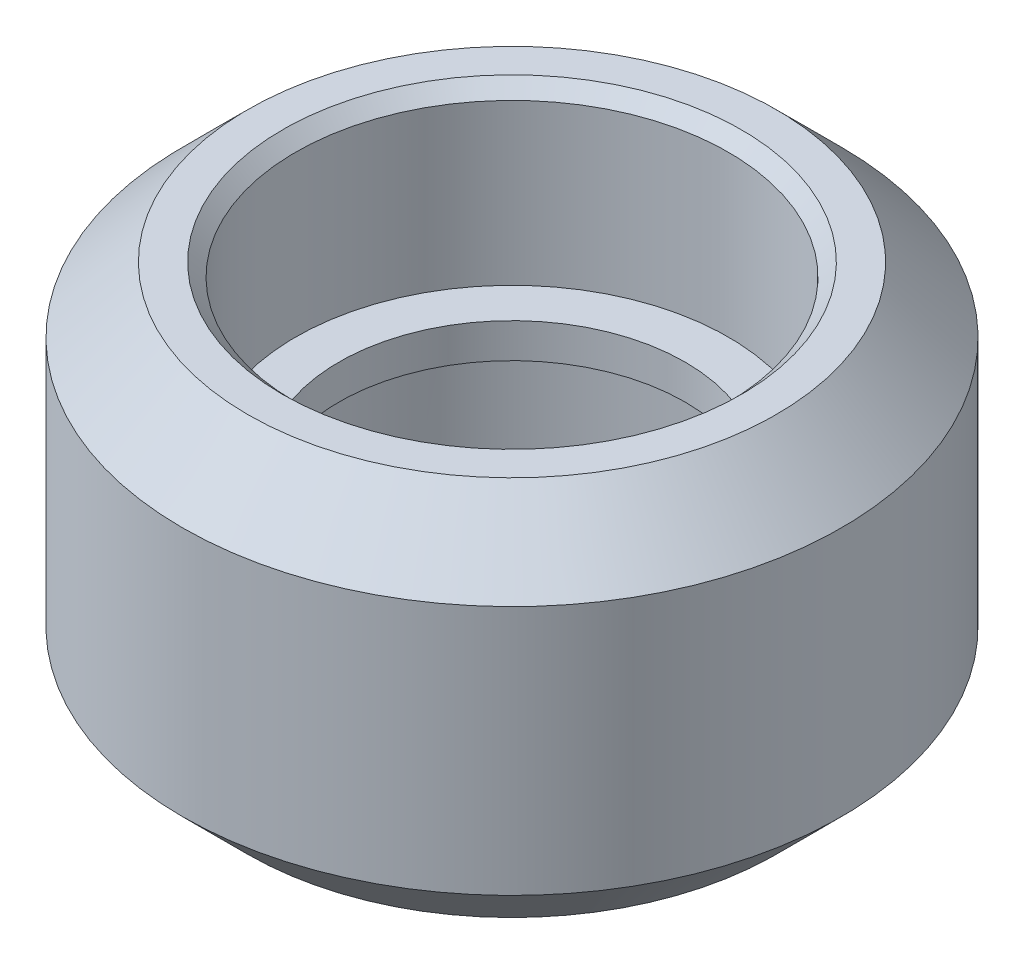
ISO-10303-21;
HEADER;
FILE_DESCRIPTION(('STEP AP214'),'2;1');
FILE_NAME('part.step','',(''),(''),'','','');
FILE_SCHEMA(('AUTOMOTIVE_DESIGN { 1 0 10303 214 1 1 1 1 }'));
ENDSEC;
DATA;
#1=APPLICATION_CONTEXT('core data for automotive mechanical design processes');
#2=APPLICATION_PROTOCOL_DEFINITION('international standard','automotive_design',2000,#1);
#3=PRODUCT_CONTEXT('',#1,'mechanical');
#4=PRODUCT('Part','Part','',(#3));
#5=PRODUCT_RELATED_PRODUCT_CATEGORY('part','',(#4));
#6=PRODUCT_DEFINITION_FORMATION('','',#4);
#7=PRODUCT_DEFINITION_CONTEXT('part definition',#1,'design');
#8=PRODUCT_DEFINITION('design','',#6,#7);
#9=PRODUCT_DEFINITION_SHAPE('','',#8);
#10=(LENGTH_UNIT() NAMED_UNIT(*) SI_UNIT(.MILLI.,.METRE.));
#11=(NAMED_UNIT(*) PLANE_ANGLE_UNIT() SI_UNIT($,.RADIAN.));
#12=(NAMED_UNIT(*) SI_UNIT($,.STERADIAN.) SOLID_ANGLE_UNIT());
#13=UNCERTAINTY_MEASURE_WITH_UNIT(LENGTH_MEASURE(1.E-05),#10,'distance_accuracy_value','');
#14=(GEOMETRIC_REPRESENTATION_CONTEXT(3) GLOBAL_UNCERTAINTY_ASSIGNED_CONTEXT((#13)) GLOBAL_UNIT_ASSIGNED_CONTEXT((#10,
#11,#12)) REPRESENTATION_CONTEXT('',''));
#15=CARTESIAN_POINT('',(0.,0.,0.));
#16=DIRECTION('',(0.,0.,1.));
#17=DIRECTION('',(1.,0.,0.));
#18=AXIS2_PLACEMENT_3D('',#15,#16,#17);
#19=CARTESIAN_POINT('',(0.,8.8,0.));
#20=DIRECTION('',(0.,-1.,0.));
#21=DIRECTION('',(0.,0.,-1.));
#22=AXIS2_PLACEMENT_3D('',#19,#20,#21);
#23=CYLINDRICAL_SURFACE('',#22,4.);
#24=CARTESIAN_POINT('',(0.,4.8,0.));
#25=DIRECTION('',(0.,1.,0.));
#26=DIRECTION('',(0.,0.,1.));
#27=AXIS2_PLACEMENT_3D('',#24,#25,#26);
#28=CIRCLE('',#27,4.);
#29=CARTESIAN_POINT('',(0.,4.8,4.));
#30=VERTEX_POINT('',#29);
#31=EDGE_CURVE('E63',#30,#30,#28,.T.);
#32=ORIENTED_EDGE('',*,*,#31,.T.);
#33=EDGE_LOOP('',(#32));
#34=FACE_BOUND('',#33,.T.);
#35=CARTESIAN_POINT('',(0.,4.,0.));
#36=DIRECTION('',(0.,-1.,0.));
#37=DIRECTION('',(0.,0.,-1.));
#38=AXIS2_PLACEMENT_3D('',#35,#36,#37);
#39=CIRCLE('',#38,4.);
#40=CARTESIAN_POINT('',(0.,4.,-4.));
#41=VERTEX_POINT('',#40);
#42=EDGE_CURVE('E64',#41,#41,#39,.T.);
#43=ORIENTED_EDGE('',*,*,#42,.T.);
#44=EDGE_LOOP('',(#43));
#45=FACE_BOUND('',#44,.T.);
#46=ADVANCED_FACE('F31',(#34,#45),#23,.F.);
#47=CARTESIAN_POINT('',(0.,8.8,0.));
#48=DIRECTION('',(0.,1.,0.));
#49=DIRECTION('',(0.,0.,1.));
#50=AXIS2_PLACEMENT_3D('',#47,#48,#49);
#51=PLANE('',#50);
#52=CARTESIAN_POINT('',(0.,8.8,0.));
#53=DIRECTION('',(0.,1.,0.));
#54=DIRECTION('',(0.,0.,1.));
#55=AXIS2_PLACEMENT_3D('',#52,#53,#54);
#56=CIRCLE('',#55,6.105);
#57=CARTESIAN_POINT('',(0.,8.8,6.105));
#58=VERTEX_POINT('',#57);
#59=EDGE_CURVE('E46',#58,#58,#56,.T.);
#60=ORIENTED_EDGE('',*,*,#59,.T.);
#61=EDGE_LOOP('',(#60));
#62=FACE_BOUND('',#61,.T.);
#63=CARTESIAN_POINT('',(0.,8.8,0.));
#64=DIRECTION('',(0.,1.,0.));
#65=DIRECTION('',(0.,0.,1.));
#66=AXIS2_PLACEMENT_3D('',#63,#64,#65);
#67=CIRCLE('',#66,5.30000000000001);
#68=CARTESIAN_POINT('',(0.,8.8,5.30000000000001));
#69=VERTEX_POINT('',#68);
#70=EDGE_CURVE('E57',#69,#69,#67,.F.);
#71=ORIENTED_EDGE('',*,*,#70,.T.);
#72=EDGE_LOOP('',(#71));
#73=FACE_BOUND('',#72,.T.);
#74=ADVANCED_FACE('F94',(#62,#73),#51,.T.);
#75=CARTESIAN_POINT('',(0.,0.,0.));
#76=DIRECTION('',(0.,1.,0.));
#77=DIRECTION('',(0.,0.,1.));
#78=AXIS2_PLACEMENT_3D('',#75,#76,#77);
#79=PLANE('',#78);
#80=CARTESIAN_POINT('',(0.,0.,0.));
#81=DIRECTION('',(0.,1.,0.));
#82=DIRECTION('',(0.,0.,1.));
#83=AXIS2_PLACEMENT_3D('',#80,#81,#82);
#84=CIRCLE('',#83,6.10499999999999);
#85=CARTESIAN_POINT('',(0.,0.,6.10499999999999));
#86=VERTEX_POINT('',#85);
#87=EDGE_CURVE('E10',#86,#86,#84,.F.);
#88=ORIENTED_EDGE('',*,*,#87,.T.);
#89=EDGE_LOOP('',(#88));
#90=FACE_BOUND('',#89,.T.);
#91=CARTESIAN_POINT('',(0.,0.,0.));
#92=DIRECTION('',(0.,1.,0.));
#93=DIRECTION('',(0.,0.,1.));
#94=AXIS2_PLACEMENT_3D('',#91,#92,#93);
#95=CIRCLE('',#94,5.3);
#96=CARTESIAN_POINT('',(0.,0.,5.3));
#97=VERTEX_POINT('',#96);
#98=EDGE_CURVE('E51',#97,#97,#95,.T.);
#99=ORIENTED_EDGE('',*,*,#98,.T.);
#100=EDGE_LOOP('',(#99));
#101=FACE_BOUND('',#100,.T.);
#102=ADVANCED_FACE('F100',(#90,#101),#79,.F.);
#103=CARTESIAN_POINT('',(0.,8.8,0.));
#104=DIRECTION('',(0.,-1.,0.));
#105=DIRECTION('',(0.,0.,-1.));
#106=AXIS2_PLACEMENT_3D('',#103,#104,#105);
#107=CYLINDRICAL_SURFACE('',#106,7.615);
#108=CARTESIAN_POINT('',(0.,7.29,0.));
#109=DIRECTION('',(0.,1.,0.));
#110=DIRECTION('',(0.,0.,1.));
#111=AXIS2_PLACEMENT_3D('',#108,#109,#110);
#112=CIRCLE('',#111,7.615);
#113=CARTESIAN_POINT('',(0.,7.29,7.615));
#114=VERTEX_POINT('',#113);
#115=EDGE_CURVE('E38',#114,#114,#112,.F.);
#116=ORIENTED_EDGE('',*,*,#115,.T.);
#117=EDGE_LOOP('',(#116));
#118=FACE_BOUND('',#117,.T.);
#119=CARTESIAN_POINT('',(0.,1.51,0.));
#120=DIRECTION('',(0.,1.,0.));
#121=DIRECTION('',(0.,0.,1.));
#122=AXIS2_PLACEMENT_3D('',#119,#120,#121);
#123=CIRCLE('',#122,7.615);
#124=CARTESIAN_POINT('',(0.,1.51,7.615));
#125=VERTEX_POINT('',#124);
#126=EDGE_CURVE('E42',#125,#125,#123,.T.);
#127=ORIENTED_EDGE('',*,*,#126,.T.);
#128=EDGE_LOOP('',(#127));
#129=FACE_BOUND('',#128,.T.);
#130=ADVANCED_FACE('F108',(#118,#129),#107,.T.);
#131=CARTESIAN_POINT('',(0.,4.8,0.));
#132=DIRECTION('',(0.,1.,0.));
#133=DIRECTION('',(0.,0.,1.));
#134=AXIS2_PLACEMENT_3D('',#131,#132,#133);
#135=CYLINDRICAL_SURFACE('',#134,5.);
#136=CARTESIAN_POINT('',(0.,8.49999999999999,0.));
#137=DIRECTION('',(0.,1.,0.));
#138=DIRECTION('',(0.,0.,1.));
#139=AXIS2_PLACEMENT_3D('',#136,#137,#138);
#140=CIRCLE('',#139,5.);
#141=CARTESIAN_POINT('',(0.,8.49999999999999,5.));
#142=VERTEX_POINT('',#141);
#143=EDGE_CURVE('E60',#142,#142,#140,.T.);
#144=ORIENTED_EDGE('',*,*,#143,.T.);
#145=EDGE_LOOP('',(#144));
#146=FACE_BOUND('',#145,.T.);
#147=CARTESIAN_POINT('',(0.,4.8,0.));
#148=DIRECTION('',(0.,1.,0.));
#149=DIRECTION('',(0.,0.,1.));
#150=AXIS2_PLACEMENT_3D('',#147,#148,#149);
#151=CIRCLE('',#150,5.);
#152=CARTESIAN_POINT('',(0.,4.8,5.));
#153=VERTEX_POINT('',#152);
#154=EDGE_CURVE('E67',#153,#153,#151,.T.);
#155=ORIENTED_EDGE('',*,*,#154,.F.);
#156=EDGE_LOOP('',(#155));
#157=FACE_BOUND('',#156,.T.);
#158=ADVANCED_FACE('F90',(#146,#157),#135,.F.);
#159=CARTESIAN_POINT('',(0.,4.8,0.));
#160=DIRECTION('',(0.,1.,0.));
#161=DIRECTION('',(0.,0.,1.));
#162=AXIS2_PLACEMENT_3D('',#159,#160,#161);
#163=PLANE('',#162);
#164=ORIENTED_EDGE('',*,*,#31,.F.);
#165=EDGE_LOOP('',(#164));
#166=FACE_BOUND('',#165,.T.);
#167=ORIENTED_EDGE('',*,*,#154,.T.);
#168=EDGE_LOOP('',(#167));
#169=FACE_BOUND('',#168,.T.);
#170=ADVANCED_FACE('F80',(#166,#169),#163,.T.);
#171=CARTESIAN_POINT('',(0.,4.,0.));
#172=DIRECTION('',(0.,-1.,0.));
#173=DIRECTION('',(0.,0.,-1.));
#174=AXIS2_PLACEMENT_3D('',#171,#172,#173);
#175=CYLINDRICAL_SURFACE('',#174,5.);
#176=CARTESIAN_POINT('',(0.,0.299999999999999,0.));
#177=DIRECTION('',(0.,1.,0.));
#178=DIRECTION('',(0.,0.,1.));
#179=AXIS2_PLACEMENT_3D('',#176,#177,#178);
#180=CIRCLE('',#179,5.);
#181=CARTESIAN_POINT('',(0.,0.299999999999999,5.));
#182=VERTEX_POINT('',#181);
#183=EDGE_CURVE('E54',#182,#182,#180,.F.);
#184=ORIENTED_EDGE('',*,*,#183,.T.);
#185=EDGE_LOOP('',(#184));
#186=FACE_BOUND('',#185,.T.);
#187=CARTESIAN_POINT('',(0.,4.,0.));
#188=DIRECTION('',(0.,-1.,0.));
#189=DIRECTION('',(0.,0.,-1.));
#190=AXIS2_PLACEMENT_3D('',#187,#188,#189);
#191=CIRCLE('',#190,5.);
#192=CARTESIAN_POINT('',(0.,4.,-5.));
#193=VERTEX_POINT('',#192);
#194=EDGE_CURVE('E68',#193,#193,#191,.T.);
#195=ORIENTED_EDGE('',*,*,#194,.F.);
#196=EDGE_LOOP('',(#195));
#197=FACE_BOUND('',#196,.T.);
#198=ADVANCED_FACE('F78',(#186,#197),#175,.F.);
#199=CARTESIAN_POINT('',(0.,4.,0.));
#200=DIRECTION('',(0.,-1.,0.));
#201=DIRECTION('',(0.,0.,-1.));
#202=AXIS2_PLACEMENT_3D('',#199,#200,#201);
#203=PLANE('',#202);
#204=ORIENTED_EDGE('',*,*,#42,.F.);
#205=EDGE_LOOP('',(#204));
#206=FACE_BOUND('',#205,.T.);
#207=ORIENTED_EDGE('',*,*,#194,.T.);
#208=EDGE_LOOP('',(#207));
#209=FACE_BOUND('',#208,.T.);
#210=ADVANCED_FACE('F76',(#206,#209),#203,.T.);
#211=CARTESIAN_POINT('',(0.,8.49999999999999,0.));
#212=DIRECTION('',(0.,1.,0.));
#213=DIRECTION('',(0.,0.,1.));
#214=AXIS2_PLACEMENT_3D('',#211,#212,#213);
#215=CONICAL_SURFACE('',#214,5.,0.785398163397455);
#216=ORIENTED_EDGE('',*,*,#70,.F.);
#217=EDGE_LOOP('',(#216));
#218=FACE_BOUND('',#217,.T.);
#219=ORIENTED_EDGE('',*,*,#143,.F.);
#220=EDGE_LOOP('',(#219));
#221=FACE_BOUND('',#220,.T.);
#222=ADVANCED_FACE('F87',(#218,#221),#215,.F.);
#223=CARTESIAN_POINT('',(0.,0.299999999999999,0.));
#224=DIRECTION('',(0.,-1.,0.));
#225=DIRECTION('',(0.,0.,-1.));
#226=AXIS2_PLACEMENT_3D('',#223,#224,#225);
#227=CONICAL_SURFACE('',#226,5.,0.785398163397448);
#228=ORIENTED_EDGE('',*,*,#98,.F.);
#229=EDGE_LOOP('',(#228));
#230=FACE_BOUND('',#229,.T.);
#231=ORIENTED_EDGE('',*,*,#183,.F.);
#232=EDGE_LOOP('',(#231));
#233=FACE_BOUND('',#232,.T.);
#234=ADVANCED_FACE('F113',(#230,#233),#227,.F.);
#235=CARTESIAN_POINT('',(0.,8.8,0.));
#236=DIRECTION('',(0.,-1.,0.));
#237=DIRECTION('',(0.,0.,-1.));
#238=AXIS2_PLACEMENT_3D('',#235,#236,#237);
#239=CONICAL_SURFACE('',#238,6.105,0.785398163397446);
#240=ORIENTED_EDGE('',*,*,#115,.F.);
#241=EDGE_LOOP('',(#240));
#242=FACE_BOUND('',#241,.T.);
#243=ORIENTED_EDGE('',*,*,#59,.F.);
#244=EDGE_LOOP('',(#243));
#245=FACE_BOUND('',#244,.T.);
#246=ADVANCED_FACE('F116',(#242,#245),#239,.T.);
#247=CARTESIAN_POINT('',(0.,1.51,0.));
#248=DIRECTION('',(0.,1.,0.));
#249=DIRECTION('',(0.,0.,1.));
#250=AXIS2_PLACEMENT_3D('',#247,#248,#249);
#251=CONICAL_SURFACE('',#250,7.615,0.785398163397451);
#252=ORIENTED_EDGE('',*,*,#87,.F.);
#253=EDGE_LOOP('',(#252));
#254=FACE_BOUND('',#253,.T.);
#255=ORIENTED_EDGE('',*,*,#126,.F.);
#256=EDGE_LOOP('',(#255));
#257=FACE_BOUND('',#256,.T.);
#258=ADVANCED_FACE('F33',(#254,#257),#251,.T.);
#259=CLOSED_SHELL('',(#46,#74,#102,#130,#158,#170,#198,#210,#222,#234,#246,#258));
#260=MANIFOLD_SOLID_BREP('B2',#259);
#261=ADVANCED_BREP_SHAPE_REPRESENTATION('',(#18,#260),#14);
#262=SHAPE_DEFINITION_REPRESENTATION(#9,#261);
ENDSEC;
END-ISO-10303-21;
